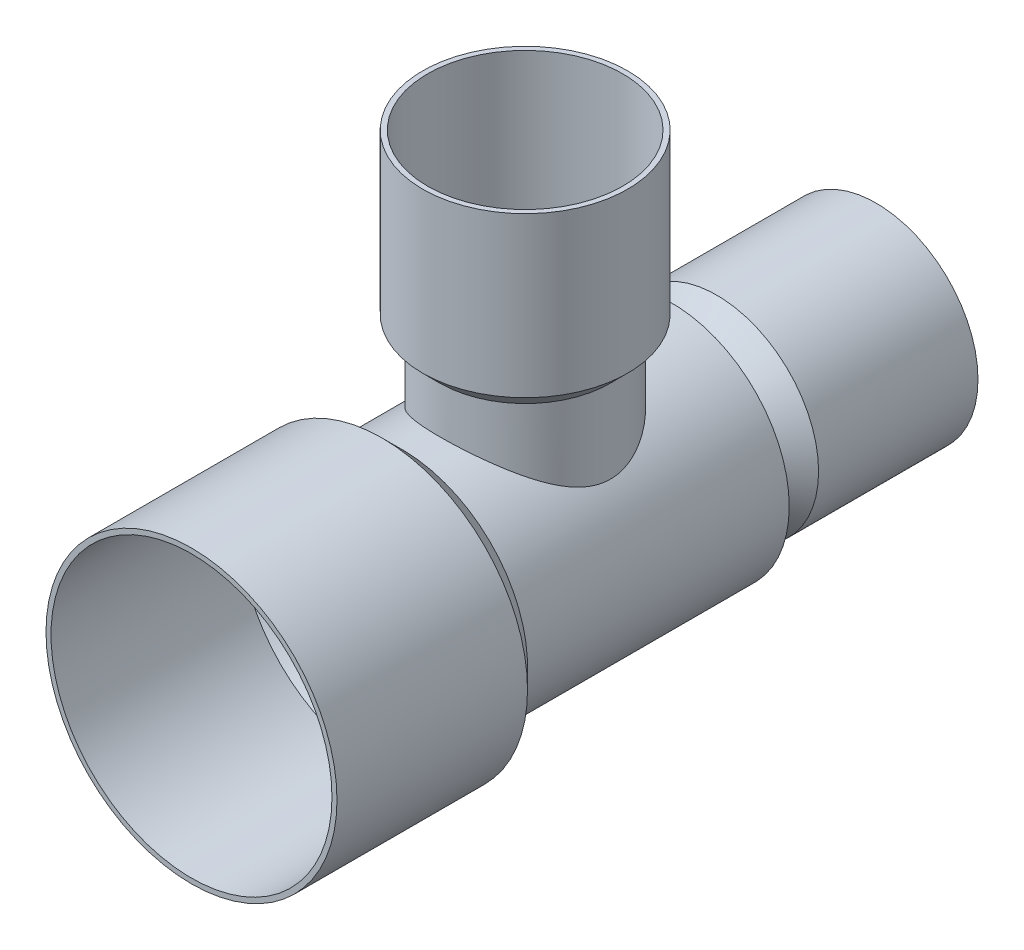
ISO-10303-21;
HEADER;
FILE_DESCRIPTION(('STEP AP214'),'2;1');
FILE_NAME('part.step','',(''),(''),'','','');
FILE_SCHEMA(('AUTOMOTIVE_DESIGN { 1 0 10303 214 1 1 1 1 }'));
ENDSEC;
DATA;
#1=APPLICATION_CONTEXT('core data for automotive mechanical design processes');
#2=APPLICATION_PROTOCOL_DEFINITION('international standard','automotive_design',2000,#1);
#3=PRODUCT_CONTEXT('',#1,'mechanical');
#4=PRODUCT('Part','Part','',(#3));
#5=PRODUCT_RELATED_PRODUCT_CATEGORY('part','',(#4));
#6=PRODUCT_DEFINITION_FORMATION('','',#4);
#7=PRODUCT_DEFINITION_CONTEXT('part definition',#1,'design');
#8=PRODUCT_DEFINITION('design','',#6,#7);
#9=PRODUCT_DEFINITION_SHAPE('','',#8);
#10=(LENGTH_UNIT() NAMED_UNIT(*) SI_UNIT(.MILLI.,.METRE.));
#11=(NAMED_UNIT(*) PLANE_ANGLE_UNIT() SI_UNIT($,.RADIAN.));
#12=(NAMED_UNIT(*) SI_UNIT($,.STERADIAN.) SOLID_ANGLE_UNIT());
#13=UNCERTAINTY_MEASURE_WITH_UNIT(LENGTH_MEASURE(1.E-05),#10,'distance_accuracy_value','');
#14=(GEOMETRIC_REPRESENTATION_CONTEXT(3) GLOBAL_UNCERTAINTY_ASSIGNED_CONTEXT((#13)) GLOBAL_UNIT_ASSIGNED_CONTEXT((#10,
#11,#12)) REPRESENTATION_CONTEXT('',''));
#15=CARTESIAN_POINT('',(0.,0.,0.));
#16=DIRECTION('',(0.,0.,1.));
#17=DIRECTION('',(1.,0.,0.));
#18=AXIS2_PLACEMENT_3D('',#15,#16,#17);
#19=CARTESIAN_POINT('',(0.,50.038,-14.3256));
#20=DIRECTION('',(0.,-1.,0.));
#21=DIRECTION('',(0.,0.,-1.));
#22=AXIS2_PLACEMENT_3D('',#19,#20,#21);
#23=PLANE('',#22);
#24=CARTESIAN_POINT('',(0.,50.038,0.));
#25=DIRECTION('',(0.,-1.,0.));
#26=DIRECTION('',(0.,0.,-1.));
#27=AXIS2_PLACEMENT_3D('',#24,#25,#26);
#28=CIRCLE('',#27,15.0622);
#29=CARTESIAN_POINT('',(0.,50.038,-15.0622));
#30=VERTEX_POINT('',#29);
#31=EDGE_CURVE('E11',#30,#30,#28,.F.);
#32=ORIENTED_EDGE('',*,*,#31,.T.);
#33=EDGE_LOOP('',(#32));
#34=FACE_BOUND('',#33,.T.);
#35=CARTESIAN_POINT('',(0.,50.038,0.));
#36=DIRECTION('',(0.,1.,0.));
#37=DIRECTION('',(0.,0.,1.));
#38=AXIS2_PLACEMENT_3D('',#35,#36,#37);
#39=CIRCLE('',#38,14.3256);
#40=CARTESIAN_POINT('',(0.,50.038,14.3256));
#41=VERTEX_POINT('',#40);
#42=EDGE_CURVE('E75',#41,#41,#39,.T.);
#43=ORIENTED_EDGE('',*,*,#42,.F.);
#44=EDGE_LOOP('',(#43));
#45=FACE_BOUND('',#44,.T.);
#46=ADVANCED_FACE('F37',(#34,#45),#23,.F.);
#47=CARTESIAN_POINT('',(0.,0.,-51.562));
#48=DIRECTION('',(0.,0.,1.));
#49=DIRECTION('',(1.,0.,0.));
#50=AXIS2_PLACEMENT_3D('',#47,#48,#49);
#51=PLANE('',#50);
#52=CARTESIAN_POINT('',(0.,0.,-51.562));
#53=DIRECTION('',(0.,0.,1.));
#54=DIRECTION('',(1.,0.,0.));
#55=AXIS2_PLACEMENT_3D('',#52,#53,#54);
#56=CIRCLE('',#55,14.9606);
#57=CARTESIAN_POINT('',(14.9606,0.,-51.562));
#58=VERTEX_POINT('',#57);
#59=EDGE_CURVE('E41',#58,#58,#56,.F.);
#60=ORIENTED_EDGE('',*,*,#59,.T.);
#61=EDGE_LOOP('',(#60));
#62=FACE_BOUND('',#61,.T.);
#63=CARTESIAN_POINT('',(0.,0.,-51.562));
#64=DIRECTION('',(0.,0.,-1.));
#65=DIRECTION('',(-1.,0.,0.));
#66=AXIS2_PLACEMENT_3D('',#63,#64,#65);
#67=CIRCLE('',#66,14.224);
#68=CARTESIAN_POINT('',(-14.224,0.,-51.562));
#69=VERTEX_POINT('',#68);
#70=EDGE_CURVE('E191',#69,#69,#67,.T.);
#71=ORIENTED_EDGE('',*,*,#70,.F.);
#72=EDGE_LOOP('',(#71));
#73=FACE_BOUND('',#72,.T.);
#74=ADVANCED_FACE('F121',(#62,#73),#51,.F.);
#75=CARTESIAN_POINT('',(0.,50.038,0.));
#76=DIRECTION('',(0.,1.,0.));
#77=DIRECTION('',(0.,0.,1.));
#78=AXIS2_PLACEMENT_3D('',#75,#76,#77);
#79=CYLINDRICAL_SURFACE('',#78,15.0622);
#80=ORIENTED_EDGE('',*,*,#31,.F.);
#81=EDGE_LOOP('',(#80));
#82=FACE_BOUND('',#81,.T.);
#83=CARTESIAN_POINT('',(0.,26.618890289956,0.));
#84=DIRECTION('',(0.,1.,0.));
#85=DIRECTION('',(0.,0.,1.));
#86=AXIS2_PLACEMENT_3D('',#83,#84,#85);
#87=CIRCLE('',#86,15.0622);
#88=CARTESIAN_POINT('',(0.,26.618890289956,15.0622));
#89=VERTEX_POINT('',#88);
#90=EDGE_CURVE('E50',#89,#89,#87,.T.);
#91=ORIENTED_EDGE('',*,*,#90,.T.);
#92=EDGE_LOOP('',(#91));
#93=FACE_BOUND('',#92,.T.);
#94=ADVANCED_FACE('F126',(#82,#93),#79,.T.);
#95=CARTESIAN_POINT('',(0.,50.038,0.));
#96=DIRECTION('',(0.,1.,0.));
#97=DIRECTION('',(0.,0.,1.));
#98=AXIS2_PLACEMENT_3D('',#95,#96,#97);
#99=CYLINDRICAL_SURFACE('',#98,12.5222);
#100=CARTESIAN_POINT('',(1.34456090077058,17.1941085126307,-12.449805172135));
#101=CARTESIAN_POINT('',(1.04960554109785,17.2171716260983,-12.4816577221123));
#102=CARTESIAN_POINT('',(0.752893083553737,17.232724220539,-12.5030845975657));
#103=CARTESIAN_POINT('',(0.158258565570606,17.2484394622937,-12.5247354042071));
#104=CARTESIAN_POINT('',(-0.139663676938202,17.2485997002302,-12.5249560159621));
#105=CARTESIAN_POINT('',(-0.734539921764581,17.233520512066,-12.50418179282));
#106=CARTESIAN_POINT('',(-1.03149331092926,17.2182727291892,-12.4831754451565));
#107=CARTESIAN_POINT('',(-1.62198778262268,17.1727127804712,-12.4202582427055));
#108=CARTESIAN_POINT('',(-1.91552897430673,17.1424010978848,-12.3783480585199));
#109=CARTESIAN_POINT('',(-2.49615375954969,17.0675083225458,-12.2744211104694));
#110=CARTESIAN_POINT('',(-2.7832553594187,17.0229743066508,-12.2124706725338));
#111=CARTESIAN_POINT('',(-3.35015045419948,16.9205402339201,-12.0692777094471));
#112=CARTESIAN_POINT('',(-3.62994387233123,16.8626400367216,-11.988034981701));
#113=CARTESIAN_POINT('',(-4.18065026197691,16.7346138021935,-11.8072710815234));
#114=CARTESIAN_POINT('',(-4.45156358990073,16.6644882562542,-11.7077506437445));
#115=CARTESIAN_POINT('',(-4.98335661892926,16.5132622237756,-11.4914789131753));
#116=CARTESIAN_POINT('',(-5.24423247080276,16.4321575797296,-11.3747210914989));
#117=CARTESIAN_POINT('',(-5.76822213611171,16.2558660426931,-11.118567602416));
#118=CARTESIAN_POINT('',(-6.03073928551594,16.1601644618955,-10.9783072846251));
#119=CARTESIAN_POINT('',(-6.54269313057134,15.9597614960201,-10.6811195006015));
#120=CARTESIAN_POINT('',(-6.79212444376587,15.8550564536565,-10.5241852551152));
#121=CARTESIAN_POINT('',(-7.27723916309594,15.6383373606618,-10.1947669159518));
#122=CARTESIAN_POINT('',(-7.51291909228215,15.5263214765688,-10.0222789174292));
#123=CARTESIAN_POINT('',(-7.97003522925165,15.2967051710687,-9.66274322737043));
#124=CARTESIAN_POINT('',(-8.19146974565239,15.1791040893923,-9.47569381273771));
#125=CARTESIAN_POINT('',(-8.66002735565722,14.9175736405543,-9.0513667169891));
#126=CARTESIAN_POINT('',(-8.90415069802936,14.772851925448,-8.81125818199132));
#127=CARTESIAN_POINT('',(-9.3713337574513,14.4809942176642,-8.31266190914105));
#128=CARTESIAN_POINT('',(-9.59438987639828,14.3338578175977,-8.05417104491043));
#129=CARTESIAN_POINT('',(-10.0190340927418,14.0403284520355,-7.51938255175463));
#130=CARTESIAN_POINT('',(-10.2206076806436,13.893936051805,-7.24307308764638));
#131=CARTESIAN_POINT('',(-10.6014115233237,13.6055978084326,-6.67330171460309));
#132=CARTESIAN_POINT('',(-10.7806456622911,13.4636511955183,-6.37984280053526));
#133=CARTESIAN_POINT('',(-11.089930763907,13.2095534599624,-5.82272683361756));
#134=CARTESIAN_POINT('',(-11.2233025803154,13.0961862886095,-5.56146623255911));
#135=CARTESIAN_POINT('',(-11.4725990699747,12.8783569129391,-5.02711344751731));
#136=CARTESIAN_POINT('',(-11.5885237350261,12.7738947128067,-4.7540212579736));
#137=CARTESIAN_POINT('',(-11.8016933590586,12.5772115856573,-4.1969404751696));
#138=CARTESIAN_POINT('',(-11.8989710581632,12.484969292719,-3.91297205023557));
#139=CARTESIAN_POINT('',(-12.0738352728174,12.3159460703532,-3.3345466985326));
#140=CARTESIAN_POINT('',(-12.1514269228824,12.2391611104255,-3.04009252955092));
#141=CARTESIAN_POINT('',(-12.2723107820328,12.1178139644925,-2.501266880353));
#142=CARTESIAN_POINT('',(-12.3193507364249,12.0698827885048,-2.25849261896897));
#143=CARTESIAN_POINT('',(-12.399198655909,11.9878428359151,-1.76832837466575));
#144=CARTESIAN_POINT('',(-12.4320099061177,11.9537308688604,-1.52093947094536));
#145=CARTESIAN_POINT('',(-12.4828245791848,11.9006580101274,-1.02326846215301));
#146=CARTESIAN_POINT('',(-12.5008428383234,11.8816819388059,-0.772989511755149));
#147=CARTESIAN_POINT('',(-12.5217843510112,11.8596106719307,-0.271088983141447));
#148=CARTESIAN_POINT('',(-12.5247074310089,11.8565156589638,-0.0194673895223337));
#149=CARTESIAN_POINT('',(-12.51539694256,11.8663429208601,0.48330393297363));
#150=CARTESIAN_POINT('',(-12.5031557444799,11.8792732585914,0.734453360596071));
#151=CARTESIAN_POINT('',(-12.4637440766511,11.9206166486355,1.2342733044769));
#152=CARTESIAN_POINT('',(-12.4365736417468,11.9490296648123,1.48294382651959));
#153=CARTESIAN_POINT('',(-12.3677511098062,12.0202490025384,1.97645569931487));
#154=CARTESIAN_POINT('',(-12.3260824858621,12.063071748318,2.22129234544067));
#155=CARTESIAN_POINT('',(-12.2288958921346,12.1615826992391,2.70567510606767));
#156=CARTESIAN_POINT('',(-12.1733698311503,12.2172784193565,2.94521804036634));
#157=CARTESIAN_POINT('',(-12.0282507437524,12.3604201665445,3.49763096042766));
#158=CARTESIAN_POINT('',(-11.9334828885486,12.4522412584906,3.80801541207961));
#159=CARTESIAN_POINT('',(-11.7221318333478,12.6513986842147,4.41596558762099));
#160=CARTESIAN_POINT('',(-11.6055496021645,12.7587343289167,4.71353188006506));
#161=CARTESIAN_POINT('',(-11.3517578832006,12.9850586959493,5.29566412197841));
#162=CARTESIAN_POINT('',(-11.2145178204916,13.1040645984722,5.58020997241222));
#163=CARTESIAN_POINT('',(-10.9206391973314,13.3499647742725,6.13545454810407));
#164=CARTESIAN_POINT('',(-10.7640021231652,13.4768584427835,6.40615433206595));
#165=CARTESIAN_POINT('',(-10.4272353852643,13.7391724473193,6.94126145452216));
#166=CARTESIAN_POINT('',(-10.2465502134178,13.8747338017022,7.20524947580339));
#167=CARTESIAN_POINT('',(-9.86609090160776,14.1478020154099,7.7180088392892));
#168=CARTESIAN_POINT('',(-9.66631673879028,14.2853088770637,7.96678016327522));
#169=CARTESIAN_POINT('',(-9.24805239159297,14.5595777867687,8.4487189691638));
#170=CARTESIAN_POINT('',(-9.0295546445001,14.6963395099009,8.68188007750826));
#171=CARTESIAN_POINT('',(-8.57429406785809,14.966522064099,9.13177990223785));
#172=CARTESIAN_POINT('',(-8.33752933476916,15.0999425450616,9.34851690244579));
#173=CARTESIAN_POINT('',(-7.79821487300854,15.3864730069679,9.80516847672354));
#174=CARTESIAN_POINT('',(-7.49183818144704,15.5383514024634,10.0413655701822));
#175=CARTESIAN_POINT('',(-6.85446116806715,15.8298576828286,10.4868020617982));
#176=CARTESIAN_POINT('',(-6.52345583644165,15.9694830626068,10.6960359514886));
#177=CARTESIAN_POINT('',(-5.83886379232392,16.2322855223453,11.0845752702996));
#178=CARTESIAN_POINT('',(-5.4853141223822,16.3554886061157,11.2639281297211));
#179=CARTESIAN_POINT('',(-4.75745971532817,16.5818220086651,11.5901208691603));
#180=CARTESIAN_POINT('',(-4.38316530832558,16.6849622046529,11.7369767527675));
#181=CARTESIAN_POINT('',(-3.72788504382176,16.841215384444,11.9578841392792));
#182=CARTESIAN_POINT('',(-3.45121299217682,16.9001704142957,12.040708736006));
#183=CARTESIAN_POINT('',(-2.89050677088366,17.005042115879,12.1874682864466));
#184=CARTESIAN_POINT('',(-2.60647427023359,17.0509617156758,12.2514074823977));
#185=CARTESIAN_POINT('',(-2.03297425915256,17.1288036966274,12.3595146609856));
#186=CARTESIAN_POINT('',(-1.74351053383967,17.1607354740216,12.4036959163234));
#187=CARTESIAN_POINT('',(-1.16094640910282,17.2099639094067,12.471715662705));
#188=CARTESIAN_POINT('',(-0.867845876374377,17.227260029321,12.4955534058243));
#189=CARTESIAN_POINT('',(-0.27960726813836,17.2468490650633,12.5225465015219));
#190=CARTESIAN_POINT('',(0.0155336926637419,17.249112206204,12.5256608087753));
#191=CARTESIAN_POINT('',(0.605022810201967,17.2385052218925,12.5110498574993));
#192=CARTESIAN_POINT('',(0.899370970349472,17.2256351616622,12.4933246887851));
#193=CARTESIAN_POINT('',(1.4851332183651,17.1850461169969,12.437301279316));
#194=CARTESIAN_POINT('',(1.77654656618508,17.1573234783188,12.3989979756285));
#195=CARTESIAN_POINT('',(2.35429376166629,17.0876324192434,12.3023811264764));
#196=CARTESIAN_POINT('',(2.64062760117626,17.0456639759875,12.2440675489037));
#197=CARTESIAN_POINT('',(3.20001413516537,16.9494502469137,12.1097600232484));
#198=CARTESIAN_POINT('',(3.47322066737313,16.8955013676848,12.0341918726072));
#199=CARTESIAN_POINT('',(4.01152752675063,16.7758423938931,11.8656097129785));
#200=CARTESIAN_POINT('',(4.27662803010261,16.7101325551643,11.7725960834774));
#201=CARTESIAN_POINT('',(4.79749231135727,16.5681063746411,11.5701182273379));
#202=CARTESIAN_POINT('',(5.05325685173413,16.4917909014739,11.4606553478735));
#203=CARTESIAN_POINT('',(5.55459695354013,16.3297612236943,11.2262441543689));
#204=CARTESIAN_POINT('',(5.80016879052476,16.2440436244743,11.1012902452069));
#205=CARTESIAN_POINT('',(6.30816782225595,16.0540973962813,10.8215555361195));
#206=CARTESIAN_POINT('',(6.5692441165898,15.9488749625474,10.6649961612575));
#207=CARTESIAN_POINT('',(7.07701658100058,15.7301467275538,10.3350405140908));
#208=CARTESIAN_POINT('',(7.32370655427444,15.6166374034944,10.1616370708098));
#209=CARTESIAN_POINT('',(7.80227603023342,15.3831286785668,9.79898973037361));
#210=CARTESIAN_POINT('',(8.03414227102818,15.263123638803,9.6097319895481));
#211=CARTESIAN_POINT('',(8.48236513211756,15.0186502432128,9.21649850312105));
#212=CARTESIAN_POINT('',(8.69872590636336,14.8941830963022,9.01252672904891));
#213=CARTESIAN_POINT('',(9.15527725797132,14.6188232081482,8.5504945143419));
#214=CARTESIAN_POINT('',(9.39220026395545,14.4673973697522,8.2895144429544));
#215=CARTESIAN_POINT('',(9.84324932262367,14.1643738897102,7.74854811381992));
#216=CARTESIAN_POINT('',(10.0573705534979,14.0127762185502,7.46855785647505));
#217=CARTESIAN_POINT('',(10.4621028953906,13.7132414475216,6.89017400752215));
#218=CARTESIAN_POINT('',(10.652712477722,13.5653045861721,6.59177922117323));
#219=CARTESIAN_POINT('',(11.0093951185683,13.2774586986658,5.97703400345357));
#220=CARTESIAN_POINT('',(11.1754755230761,13.1375472767606,5.66068898725851));
#221=CARTESIAN_POINT('',(11.4453115893983,12.9024823824461,5.08776533185127));
#222=CARTESIAN_POINT('',(11.5544974641951,12.8045959339134,4.83485751103322));
#223=CARTESIAN_POINT('',(11.7570083755159,12.6189077925319,4.31913980422897));
#224=CARTESIAN_POINT('',(11.8503344070077,12.5311054671676,4.05633054067465));
#225=CARTESIAN_POINT('',(12.019982258127,12.3684693994092,3.52192479821783));
#226=CARTESIAN_POINT('',(12.0963360312348,12.2936113470418,3.2503459534128));
#227=CARTESIAN_POINT('',(12.2311639493995,12.1594782519031,2.69899989906632));
#228=CARTESIAN_POINT('',(12.2896413538265,12.1002003687009,2.41923419242729));
#229=CARTESIAN_POINT('',(12.3803314680599,12.007337824601,1.89542039349734));
#230=CARTESIAN_POINT('',(12.4151610452342,11.9712393717642,1.65227056002616));
#231=CARTESIAN_POINT('',(12.470542433728,11.913538387462,1.16264217802578));
#232=CARTESIAN_POINT('',(12.4910958232025,11.8919342537374,0.9161640004988));
#233=CARTESIAN_POINT('',(12.5175452374396,11.8640906354179,0.421686395358653));
#234=CARTESIAN_POINT('',(12.5234494149726,11.8578426046627,0.173687890937244));
#235=CARTESIAN_POINT('',(12.5205106608401,11.8609455179611,-0.322130072000294));
#236=CARTESIAN_POINT('',(12.5116673256724,11.8702968888249,-0.569949525431864));
#237=CARTESIAN_POINT('',(12.4794363946505,11.9041764200966,-1.06305581368968));
#238=CARTESIAN_POINT('',(12.4560793983498,11.9286726496333,-1.30834687593218));
#239=CARTESIAN_POINT('',(12.3952656266146,11.9918519413242,-1.79529965844101));
#240=CARTESIAN_POINT('',(12.3578089039665,12.030534950366,-2.03696139229128));
#241=CARTESIAN_POINT('',(12.2693272342035,12.1207592560818,-2.51563535002449));
#242=CARTESIAN_POINT('',(12.2182859221344,12.1723160567724,-2.75264159331236));
#243=CARTESIAN_POINT('',(12.1033157222789,12.286640169895,-3.22077157056563));
#244=CARTESIAN_POINT('',(12.0393834708036,12.3494104078093,-3.45189375141248));
#245=CARTESIAN_POINT('',(11.8692167345837,12.5134416955795,-4.0054026846984));
#246=CARTESIAN_POINT('',(11.7566043751075,12.6196585663854,-4.32437506955656));
#247=CARTESIAN_POINT('',(11.5081536442993,12.8466305336933,-4.94778787872182));
#248=CARTESIAN_POINT('',(11.3723055082338,12.9673917360489,-5.25222212435251));
#249=CARTESIAN_POINT('',(11.0785645764641,13.2192323069227,-5.84644464512642));
#250=CARTESIAN_POINT('',(10.920636716965,13.3503279397494,-6.13620860607302));
#251=CARTESIAN_POINT('',(10.5839636895903,13.6187841630395,-6.70022908965719));
#252=CARTESIAN_POINT('',(10.4052208276933,13.7561440584963,-6.97448732509679));
#253=CARTESIAN_POINT('',(10.0221788228574,14.03778038218,-7.51493653403785));
#254=CARTESIAN_POINT('',(9.81729029691888,14.1821419675044,-7.78066515227076));
#255=CARTESIAN_POINT('',(9.38680582815815,14.4706683355694,-8.2949270103547));
#256=CARTESIAN_POINT('',(9.16120870704416,14.6148331066375,-8.54345927034285));
#257=CARTESIAN_POINT('',(8.68992461499414,14.8998731494056,-9.02238857518042));
#258=CARTESIAN_POINT('',(8.44425020010735,15.0407504072587,-9.25279678024964));
#259=CARTESIAN_POINT('',(7.93317134728956,15.3164712986556,-9.69455223811933));
#260=CARTESIAN_POINT('',(7.66776881138709,15.4513155118547,-9.90590132411143));
#261=CARTESIAN_POINT('',(7.13701680252703,15.7031323050917,-10.2941199708794));
#262=CARTESIAN_POINT('',(6.87295555373936,15.8206953875419,-10.4723663499623));
#263=CARTESIAN_POINT('',(6.32897791436464,16.0460552932628,-10.8098075068937));
#264=CARTESIAN_POINT('',(6.04906385503441,16.1538535464844,-10.9690050753286));
#265=CARTESIAN_POINT('',(5.474741998558,16.3574174999957,-11.2666390621789));
#266=CARTESIAN_POINT('',(5.18035513626729,16.4531999075007,-11.4051043604715));
#267=CARTESIAN_POINT('',(4.57813128193065,16.6308262852116,-11.65988890283));
#268=CARTESIAN_POINT('',(4.27029859290699,16.7126746741974,-11.7762151690491));
#269=CARTESIAN_POINT('',(3.74745394318527,16.8359159841604,-11.950345449375));
#270=CARTESIAN_POINT('',(3.53564400802603,16.8817074860083,-12.0147421093613));
#271=CARTESIAN_POINT('',(3.10752077307258,16.9657327117051,-12.1325213599562));
#272=CARTESIAN_POINT('',(2.89120808595406,17.0039674564443,-12.1859054383672));
#273=CARTESIAN_POINT('',(2.45477083136642,17.0724372199445,-12.2812660528638));
#274=CARTESIAN_POINT('',(2.23464533626234,17.1026702619608,-12.3232397701975));
#275=CARTESIAN_POINT('',(1.79153763557279,17.1547478677482,-12.3954135514274));
#276=CARTESIAN_POINT('',(1.56855594400275,17.1765939195615,-12.4256157038808));
#277=CARTESIAN_POINT('',(1.34456090077058,17.1941085126307,-12.449805172135));
#278=B_SPLINE_CURVE_WITH_KNOTS('',3,(#100,#101,#102,#103,#104,#105,#106,#107,#108,#109,#110,
#111,#112,#113,#114,#115,#116,#117,#118,#119,#120,#121,#122,#123,#124,#125,#126,#127,#128,#129,
#130,#131,#132,#133,#134,#135,#136,#137,#138,#139,#140,#141,#142,#143,#144,#145,#146,#147,#148,
#149,#150,#151,#152,#153,#154,#155,#156,#157,#158,#159,#160,#161,#162,#163,#164,#165,#166,#167,
#168,#169,#170,#171,#172,#173,#174,#175,#176,#177,#178,#179,#180,#181,#182,#183,#184,#185,#186,
#187,#188,#189,#190,#191,#192,#193,#194,#195,#196,#197,#198,#199,#200,#201,#202,#203,#204,#205,
#206,#207,#208,#209,#210,#211,#212,#213,#214,#215,#216,#217,#218,#219,#220,#221,#222,#223,#224,
#225,#226,#227,#228,#229,#230,#231,#232,#233,#234,#235,#236,#237,#238,#239,#240,#241,#242,#243,
#244,#245,#246,#247,#248,#249,#250,#251,#252,#253,#254,#255,#256,#257,#258,#259,#260,#261,#262,
#263,#264,#265,#266,#267,#268,#269,#270,#271,#272,#273,#274,#275,#276,#277),.UNSPECIFIED.,.T.,
.F.,(4,2,2,2,2,2,2,2,2,2,2,2,2,2,2,2,2,2,2,2,2,2,2,2,2,2,2,2,2,2,2,2,2,2,2,2,2,2,2,2,2,2,2,2,2,
2,2,2,2,2,2,2,2,2,2,2,2,2,2,2,2,2,2,2,2,2,2,2,2,2,2,2,2,2,2,2,2,2,2,2,2,2,2,2,2,2,2,2,4),(0.,
0.892480885177587,1.78510147085882,2.67820644296431,3.57128276581433,4.46143306447451,
5.35159271132645,6.2417165870151,7.13217847794263,8.06921644218135,9.00663685407003,
9.94429326865868,10.8820608081278,11.9961746069851,13.1104783442262,14.2255299852349,
15.3403874795006,16.2830745685454,17.225762100618,18.1667790001852,19.1075502108206,
19.8624765435203,20.6172284862527,21.3712225404884,22.1252252634857,22.879607503498,
23.6339879828135,24.3892312351082,25.1449165013764,26.1551999330537,27.1654385069619,
28.1771872751418,29.1888585665546,30.2302883532493,31.2717193867967,32.3135730694876,
33.355535467188,34.6006071959087,35.845932885553,37.0892626319068,38.3319787137416,
39.2153627338072,40.0985481676839,40.9811394136257,41.8637631064284,42.7481344254981,
43.6325019330631,44.5170871253188,45.4016737369703,46.2664239138262,47.1311552822024,
47.9958158686665,48.8607896721072,49.826137237903,50.7918975946671,51.7585102049436,
52.724862881791,53.874567602453,55.0245149662791,56.1745370583476,57.3242140406347,
58.2005698707278,59.0768707023071,59.9515074894295,60.8259847101561,61.5699979269491,
62.3139288840264,63.0574457259884,63.8009829114174,64.5429577709339,65.284929852676,
66.0277998441112,66.7708639272708,67.8329169574506,68.8954174123347,69.9596247570805,
71.0237143161578,72.1185626549306,73.2134733277894,74.3077044237794,75.4018301592021,
76.4196191601889,77.4372588755048,78.4534675685563,79.4693533970081,80.1471660564472,
80.8248870831766,81.5027753785054,82.1805433454312),.UNSPECIFIED.);
#279=CARTESIAN_POINT('',(1.34456090077058,17.1941085126307,-12.449805172135));
#280=VERTEX_POINT('',#279);
#281=EDGE_CURVE('E62',#280,#280,#278,.T.);
#282=ORIENTED_EDGE('',*,*,#281,.T.);
#283=EDGE_LOOP('',(#282));
#284=FACE_BOUND('',#283,.T.);
#285=CARTESIAN_POINT('',(0.,24.078890289956,0.));
#286=DIRECTION('',(0.,1.,0.));
#287=DIRECTION('',(0.,0.,1.));
#288=AXIS2_PLACEMENT_3D('',#285,#286,#287);
#289=CIRCLE('',#288,12.5222);
#290=CARTESIAN_POINT('',(0.,24.078890289956,12.5222));
#291=VERTEX_POINT('',#290);
#292=EDGE_CURVE('E45',#291,#291,#289,.T.);
#293=ORIENTED_EDGE('',*,*,#292,.F.);
#294=EDGE_LOOP('',(#293));
#295=FACE_BOUND('',#294,.T.);
#296=ADVANCED_FACE('F133',(#284,#295),#99,.T.);
#297=CARTESIAN_POINT('',(0.,23.863145144978,0.));
#298=DIRECTION('',(0.,1.,0.));
#299=DIRECTION('',(0.,0.,1.));
#300=AXIS2_PLACEMENT_3D('',#297,#298,#299);
#301=CONICAL_SURFACE('',#300,12.306454855022,0.78539816339745);
#302=ORIENTED_EDGE('',*,*,#90,.F.);
#303=EDGE_LOOP('',(#302));
#304=FACE_BOUND('',#303,.T.);
#305=ORIENTED_EDGE('',*,*,#292,.T.);
#306=EDGE_LOOP('',(#305));
#307=FACE_BOUND('',#306,.T.);
#308=ADVANCED_FACE('F137',(#304,#307),#301,.T.);
#309=CARTESIAN_POINT('',(0.,0.,-51.562));
#310=DIRECTION('',(0.,0.,1.));
#311=DIRECTION('',(0.,-1.,0.));
#312=AXIS2_PLACEMENT_3D('',#309,#310,#311);
#313=CYLINDRICAL_SURFACE('',#312,17.2466);
#314=CARTESIAN_POINT('',(0.,0.,-21.5437489673051));
#315=DIRECTION('',(0.,0.,1.));
#316=DIRECTION('',(1.,0.,0.));
#317=AXIS2_PLACEMENT_3D('',#314,#315,#316);
#318=CIRCLE('',#317,17.2466);
#319=CARTESIAN_POINT('',(17.2466,0.,-21.5437489673051));
#320=VERTEX_POINT('',#319);
#321=EDGE_CURVE('E74',#320,#320,#318,.T.);
#322=ORIENTED_EDGE('',*,*,#321,.T.);
#323=EDGE_LOOP('',(#322));
#324=FACE_BOUND('',#323,.T.);
#325=CARTESIAN_POINT('',(0.,0.,18.0594));
#326=DIRECTION('',(0.,0.,-1.));
#327=DIRECTION('',(-1.,0.,0.));
#328=AXIS2_PLACEMENT_3D('',#325,#326,#327);
#329=CIRCLE('',#328,17.2466);
#330=CARTESIAN_POINT('',(-17.2466,0.,18.0594));
#331=VERTEX_POINT('',#330);
#332=EDGE_CURVE('E57',#331,#331,#329,.F.);
#333=ORIENTED_EDGE('',*,*,#332,.F.);
#334=EDGE_LOOP('',(#333));
#335=FACE_BOUND('',#334,.T.);
#336=ORIENTED_EDGE('',*,*,#281,.F.);
#337=EDGE_LOOP('',(#336));
#338=FACE_BOUND('',#337,.T.);
#339=ADVANCED_FACE('F139',(#324,#335,#338),#313,.T.);
#340=CARTESIAN_POINT('',(0.,0.,20.815145144978));
#341=DIRECTION('',(0.,0.,1.));
#342=DIRECTION('',(-1.,0.,0.));
#343=AXIS2_PLACEMENT_3D('',#340,#341,#342);
#344=CONICAL_SURFACE('',#343,21.158354855022,0.78539816339745);
#345=CARTESIAN_POINT('',(0.,0.,18.0594));
#346=DIRECTION('',(0.,0.,-1.));
#347=DIRECTION('',(-1.,0.,0.));
#348=AXIS2_PLACEMENT_3D('',#345,#346,#347);
#349=CIRCLE('',#348,18.402609710044);
#350=CARTESIAN_POINT('',(-18.402609710044,0.,18.0594));
#351=VERTEX_POINT('',#350);
#352=EDGE_CURVE('E58',#351,#351,#349,.T.);
#353=ORIENTED_EDGE('',*,*,#352,.F.);
#354=EDGE_LOOP('',(#353));
#355=FACE_BOUND('',#354,.T.);
#356=CARTESIAN_POINT('',(0.,0.,21.030890289956));
#357=DIRECTION('',(0.,0.,1.));
#358=DIRECTION('',(1.,0.,0.));
#359=AXIS2_PLACEMENT_3D('',#356,#357,#358);
#360=CIRCLE('',#359,21.3741);
#361=CARTESIAN_POINT('',(21.3741,0.,21.030890289956));
#362=VERTEX_POINT('',#361);
#363=EDGE_CURVE('E65',#362,#362,#360,.F.);
#364=ORIENTED_EDGE('',*,*,#363,.T.);
#365=EDGE_LOOP('',(#364));
#366=FACE_BOUND('',#365,.T.);
#367=ADVANCED_FACE('F160',(#355,#366),#344,.T.);
#368=CARTESIAN_POINT('',(0.,0.,18.0594));
#369=DIRECTION('',(0.,0.,-1.));
#370=DIRECTION('',(-1.,0.,0.));
#371=AXIS2_PLACEMENT_3D('',#368,#369,#370);
#372=PLANE('',#371);
#373=ORIENTED_EDGE('',*,*,#332,.T.);
#374=EDGE_LOOP('',(#373));
#375=FACE_BOUND('',#374,.T.);
#376=ORIENTED_EDGE('',*,*,#352,.T.);
#377=EDGE_LOOP('',(#376));
#378=FACE_BOUND('',#377,.T.);
#379=ADVANCED_FACE('F165',(#375,#378),#372,.T.);
#380=CARTESIAN_POINT('',(0.,0.,49.022));
#381=DIRECTION('',(0.,0.,1.));
#382=DIRECTION('',(1.,0.,0.));
#383=AXIS2_PLACEMENT_3D('',#380,#381,#382);
#384=PLANE('',#383);
#385=CARTESIAN_POINT('',(0.,0.,49.022));
#386=DIRECTION('',(0.,0.,1.));
#387=DIRECTION('',(1.,0.,0.));
#388=AXIS2_PLACEMENT_3D('',#385,#386,#387);
#389=CIRCLE('',#388,20.6375);
#390=CARTESIAN_POINT('',(20.6375,0.,49.022));
#391=VERTEX_POINT('',#390);
#392=EDGE_CURVE('E206',#391,#391,#389,.T.);
#393=ORIENTED_EDGE('',*,*,#392,.F.);
#394=EDGE_LOOP('',(#393));
#395=FACE_BOUND('',#394,.T.);
#396=CARTESIAN_POINT('',(0.,0.,49.022));
#397=DIRECTION('',(0.,0.,1.));
#398=DIRECTION('',(1.,0.,0.));
#399=AXIS2_PLACEMENT_3D('',#396,#397,#398);
#400=CIRCLE('',#399,21.3741);
#401=CARTESIAN_POINT('',(21.3741,0.,49.022));
#402=VERTEX_POINT('',#401);
#403=EDGE_CURVE('E55',#402,#402,#400,.T.);
#404=ORIENTED_EDGE('',*,*,#403,.T.);
#405=EDGE_LOOP('',(#404));
#406=FACE_BOUND('',#405,.T.);
#407=ADVANCED_FACE('F132',(#395,#406),#384,.T.);
#408=CARTESIAN_POINT('',(0.,0.,21.336));
#409=DIRECTION('',(0.,0.,1.));
#410=DIRECTION('',(1.,0.,0.));
#411=AXIS2_PLACEMENT_3D('',#408,#409,#410);
#412=CYLINDRICAL_SURFACE('',#411,21.3741);
#413=ORIENTED_EDGE('',*,*,#363,.F.);
#414=EDGE_LOOP('',(#413));
#415=FACE_BOUND('',#414,.T.);
#416=ORIENTED_EDGE('',*,*,#403,.F.);
#417=EDGE_LOOP('',(#416));
#418=FACE_BOUND('',#417,.T.);
#419=ADVANCED_FACE('F170',(#415,#418),#412,.T.);
#420=CARTESIAN_POINT('',(0.,0.,-25.2759143124276));
#421=DIRECTION('',(0.,0.,1.));
#422=DIRECTION('',(-1.,0.,0.));
#423=AXIS2_PLACEMENT_3D('',#420,#421,#422);
#424=CONICAL_SURFACE('',#423,10.7823,1.0471975511966);
#425=ORIENTED_EDGE('',*,*,#321,.F.);
#426=EDGE_LOOP('',(#425));
#427=FACE_BOUND('',#426,.T.);
#428=CARTESIAN_POINT('',(0.,0.,-24.7959364076102));
#429=DIRECTION('',(0.,0.,-1.));
#430=DIRECTION('',(-1.,0.,0.));
#431=AXIS2_PLACEMENT_3D('',#428,#429,#430);
#432=CIRCLE('',#431,11.6136461176542);
#433=CARTESIAN_POINT('',(-11.6136461176542,0.,-24.7959364076102));
#434=VERTEX_POINT('',#433);
#435=EDGE_CURVE('E72',#434,#434,#432,.T.);
#436=ORIENTED_EDGE('',*,*,#435,.F.);
#437=EDGE_LOOP('',(#436));
#438=FACE_BOUND('',#437,.T.);
#439=ADVANCED_FACE('F173',(#427,#438),#424,.T.);
#440=CARTESIAN_POINT('',(0.,0.,-28.448));
#441=DIRECTION('',(0.,0.,-1.));
#442=DIRECTION('',(-1.,0.,0.));
#443=AXIS2_PLACEMENT_3D('',#440,#441,#442);
#444=CYLINDRICAL_SURFACE('',#443,14.9606);
#445=CARTESIAN_POINT('',(0.,0.,-28.142890289956));
#446=DIRECTION('',(0.,0.,-1.));
#447=DIRECTION('',(-1.,0.,0.));
#448=AXIS2_PLACEMENT_3D('',#445,#446,#447);
#449=CIRCLE('',#448,14.9606);
#450=CARTESIAN_POINT('',(-14.9606,0.,-28.142890289956));
#451=VERTEX_POINT('',#450);
#452=EDGE_CURVE('E53',#451,#451,#449,.T.);
#453=ORIENTED_EDGE('',*,*,#452,.T.);
#454=EDGE_LOOP('',(#453));
#455=FACE_BOUND('',#454,.T.);
#456=ORIENTED_EDGE('',*,*,#59,.F.);
#457=EDGE_LOOP('',(#456));
#458=FACE_BOUND('',#457,.T.);
#459=ADVANCED_FACE('F176',(#455,#458),#444,.T.);
#460=CARTESIAN_POINT('',(0.,0.,-27.927145144978));
#461=DIRECTION('',(0.,0.,-1.));
#462=DIRECTION('',(-1.,0.,0.));
#463=AXIS2_PLACEMENT_3D('',#460,#461,#462);
#464=CONICAL_SURFACE('',#463,14.744854855022,0.78539816339745);
#465=ORIENTED_EDGE('',*,*,#435,.T.);
#466=EDGE_LOOP('',(#465));
#467=FACE_BOUND('',#466,.T.);
#468=ORIENTED_EDGE('',*,*,#452,.F.);
#469=EDGE_LOOP('',(#468));
#470=FACE_BOUND('',#469,.T.);
#471=ADVANCED_FACE('F39',(#467,#470),#464,.T.);
#472=CARTESIAN_POINT('',(0.,50.038,0.));
#473=DIRECTION('',(0.,1.,0.));
#474=DIRECTION('',(0.,0.,1.));
#475=AXIS2_PLACEMENT_3D('',#472,#473,#474);
#476=CYLINDRICAL_SURFACE('',#475,14.3256);
#477=ORIENTED_EDGE('',*,*,#42,.T.);
#478=EDGE_LOOP('',(#477));
#479=FACE_BOUND('',#478,.T.);
#480=CARTESIAN_POINT('',(0.,26.924,0.));
#481=DIRECTION('',(0.,1.,0.));
#482=DIRECTION('',(0.,0.,1.));
#483=AXIS2_PLACEMENT_3D('',#480,#481,#482);
#484=CIRCLE('',#483,14.3256);
#485=CARTESIAN_POINT('',(0.,26.924,14.3256));
#486=VERTEX_POINT('',#485);
#487=EDGE_CURVE('E85',#486,#486,#484,.T.);
#488=ORIENTED_EDGE('',*,*,#487,.F.);
#489=EDGE_LOOP('',(#488));
#490=FACE_BOUND('',#489,.T.);
#491=ADVANCED_FACE('F116',(#479,#490),#476,.F.);
#492=CARTESIAN_POINT('',(0.,50.038,0.));
#493=DIRECTION('',(0.,1.,0.));
#494=DIRECTION('',(0.,0.,1.));
#495=AXIS2_PLACEMENT_3D('',#492,#493,#494);
#496=CYLINDRICAL_SURFACE('',#495,11.7856);
#497=CARTESIAN_POINT('',(0.,16.51,11.7856));
#498=CARTESIAN_POINT('',(0.29169127283947,16.5100003514069,11.7856003627677));
#499=CARTESIAN_POINT('',(0.583377560796356,16.5022539190606,11.7747561037642));
#500=CARTESIAN_POINT('',(1.16432655776523,16.4714618302148,11.7315621905584));
#501=CARTESIAN_POINT('',(1.4535893276815,16.4484165593578,11.6992130784357));
#502=CARTESIAN_POINT('',(2.02750636445264,16.387575474934,11.6135182561208));
#503=CARTESIAN_POINT('',(2.31215891404158,16.3497742908061,11.5601649011659));
#504=CARTESIAN_POINT('',(2.87468726462994,16.2603012491176,11.4332710351912));
#505=CARTESIAN_POINT('',(3.1525629279313,16.2086291099719,11.3597301143563));
#506=CARTESIAN_POINT('',(3.69836130948366,16.0928451441937,11.193901711687));
#507=CARTESIAN_POINT('',(3.96632760958165,16.0287981939213,11.1017118853782));
#508=CARTESIAN_POINT('',(4.49236388689646,15.8893931421704,10.8994700739479));
#509=CARTESIAN_POINT('',(4.75043393050397,15.814035116591,10.7894182086827));
#510=CARTESIAN_POINT('',(5.25551278170939,15.6534311047933,10.5526177729681));
#511=CARTESIAN_POINT('',(5.50252358358113,15.5681869113476,10.4258722292116));
#512=CARTESIAN_POINT('',(5.98476986262616,15.3892433647399,10.1567310740588));
#513=CARTESIAN_POINT('',(6.22000091684873,15.2955408721975,10.0143296475191));
#514=CARTESIAN_POINT('',(6.6984435571011,15.0925272745232,9.70154873332772));
#515=CARTESIAN_POINT('',(6.94048924962359,14.9825696400477,9.52980618210788));
#516=CARTESIAN_POINT('',(7.40915608719233,14.7564296489171,9.17017104110195));
#517=CARTESIAN_POINT('',(7.6357767614645,14.6402471024698,8.98227795879468));
#518=CARTESIAN_POINT('',(8.07348873425211,14.4035022717015,8.59100993030496));
#519=CARTESIAN_POINT('',(8.28455590427672,14.2829335985436,8.3876118855629));
#520=CARTESIAN_POINT('',(8.69035710618936,14.0397203782095,7.96640284257183));
#521=CARTESIAN_POINT('',(8.88509436088613,13.917076246407,7.7485947034947));
#522=CARTESIAN_POINT('',(9.29221822129966,13.6493413573427,7.25772621085809));
#523=CARTESIAN_POINT('',(9.50126313335178,13.5042710437892,6.9818717878263));
#524=CARTESIAN_POINT('',(9.89525498933722,13.2182940417017,6.4112814693278));
#525=CARTESIAN_POINT('',(10.0801953725816,13.0773884947552,6.11654046580061));
#526=CARTESIAN_POINT('',(10.4245893956405,12.8045395960191,5.50908946135526));
#527=CARTESIAN_POINT('',(10.5840739260096,12.6725854952927,5.1964018750502));
#528=CARTESIAN_POINT('',(10.8761890756426,12.4227828404771,4.55339717247887));
#529=CARTESIAN_POINT('',(11.0088342552351,12.3049266525448,4.22308973853762));
#530=CARTESIAN_POINT('',(11.2072855315218,12.1238889203481,3.6546456019841));
#531=CARTESIAN_POINT('',(11.2808831951145,12.0552961204819,3.42093035726757));
#532=CARTESIAN_POINT('',(11.4139687848284,11.9293675964822,2.94657803056825));
#533=CARTESIAN_POINT('',(11.4734610283496,11.8720284287545,2.70594309192322));
#534=CARTESIAN_POINT('',(11.5774617653944,11.7706312844495,2.21913843297348));
#535=CARTESIAN_POINT('',(11.6219964863482,11.7265500749012,1.97297921669075));
#536=CARTESIAN_POINT('',(11.6954889798381,11.6532547051097,1.47612805542113));
#537=CARTESIAN_POINT('',(11.7244467592187,11.6240405383339,1.22543611242601));
#538=CARTESIAN_POINT('',(11.7663599585136,11.5816139441591,0.719678740250826));
#539=CARTESIAN_POINT('',(11.7792089111482,11.5685079910466,0.46459539297483));
#540=CARTESIAN_POINT('',(11.7882769489896,11.5592677408311,-0.0461701638607818));
#541=CARTESIAN_POINT('',(11.7844965459005,11.5631329215073,-0.301852354751335));
#542=CARTESIAN_POINT('',(11.7603809207432,11.5876585352006,-0.811796853392607));
#543=CARTESIAN_POINT('',(11.7400338958244,11.6083309424715,-1.06605801865781));
#544=CARTESIAN_POINT('',(11.6831942570202,11.6655338616849,-1.57095778451463));
#545=CARTESIAN_POINT('',(11.646699812274,11.7020661718793,-1.82159597098928));
#546=CARTESIAN_POINT('',(11.5525615161308,11.7950557045474,-2.34934919467766));
#547=CARTESIAN_POINT('',(11.4928070482175,11.8534660396465,-2.62574228305557));
#548=CARTESIAN_POINT('',(11.3547444548565,11.985782906484,-3.17001994206212));
#549=CARTESIAN_POINT('',(11.2764334844869,12.0596918141291,-3.43790320088885));
#550=CARTESIAN_POINT('',(11.1022559344367,12.220231165096,-3.96451056917933));
#551=CARTESIAN_POINT('',(11.006357556168,12.3068845937848,-4.22321705898695));
#552=CARTESIAN_POINT('',(10.7981326801274,12.4899822554631,-4.73031157385693));
#553=CARTESIAN_POINT('',(10.6858047469374,12.5864273437053,-4.97869869489885));
#554=CARTESIAN_POINT('',(10.4084241997534,12.8174348947332,-5.53995166966971));
#555=CARTESIAN_POINT('',(10.2378059545094,12.9545655221643,-5.84901927409531));
#556=CARTESIAN_POINT('',(9.87129023004059,13.2359795405201,-6.44836744454961));
#557=CARTESIAN_POINT('',(9.67538561705046,13.3802649428418,-6.73864267405804));
#558=CARTESIAN_POINT('',(9.2591475139269,13.6716084703262,-7.30005116145778));
#559=CARTESIAN_POINT('',(9.03879412081252,13.8186687724227,-7.57116852528724));
#560=CARTESIAN_POINT('',(8.57454564687617,14.1114343823115,-8.09317734908166));
#561=CARTESIAN_POINT('',(8.33065296651023,14.2571398266097,-8.34407086662675));
#562=CARTESIAN_POINT('',(7.81740128196525,14.5449564930393,-8.82688790615476));
#563=CARTESIAN_POINT('',(7.5478141677179,14.6870178839919,-9.05859915412158));
#564=CARTESIAN_POINT('',(6.98594561164647,14.9624378728491,-9.49864460974121));
#565=CARTESIAN_POINT('',(6.69366192230944,15.0957956064671,-9.70697649726128));
#566=CARTESIAN_POINT('',(6.08805060449775,15.3500288243361,-10.0978030983933));
#567=CARTESIAN_POINT('',(5.7747647910951,15.4709279627818,-10.280347027656));
#568=CARTESIAN_POINT('',(5.12824781929503,15.69707993165,-10.6176381753531));
#569=CARTESIAN_POINT('',(4.79502422505838,15.8023386437314,-10.77239584753));
#570=CARTESIAN_POINT('',(4.19840252257318,15.9694549793372,-11.0158723350809));
#571=CARTESIAN_POINT('',(3.93892583870028,16.0355293434773,-11.1113603002722));
#572=CARTESIAN_POINT('',(3.41145467807837,16.1559649722619,-11.2844735916928));
#573=CARTESIAN_POINT('',(3.14346204467501,16.2103287522037,-11.3621027540289));
#574=CARTESIAN_POINT('',(2.60060923061714,16.3062215759191,-11.4984990461366));
#575=CARTESIAN_POINT('',(2.3257527291665,16.3477573427237,-11.5572760567533));
#576=CARTESIAN_POINT('',(1.77083817958227,16.4171376353767,-11.6552079198908));
#577=CARTESIAN_POINT('',(1.49077998561101,16.4449817767556,-11.6943622213943));
#578=CARTESIAN_POINT('',(0.926615706661499,16.4864105236255,-11.7525494791659));
#579=CARTESIAN_POINT('',(0.642499550498304,16.4999493047505,-11.7715177749773));
#580=CARTESIAN_POINT('',(0.0733176826318491,16.5122909356326,-11.7888106422745));
#581=CARTESIAN_POINT('',(-0.211748027006379,16.5110938174155,-11.7871352586257));
#582=CARTESIAN_POINT('',(-0.780590019377176,16.493991627292,-11.7631669612496));
#583=CARTESIAN_POINT('',(-1.06436617730449,16.4780851610201,-11.7408720929083));
#584=CARTESIAN_POINT('',(-1.62840051790732,16.43193470414,-11.6760123489894));
#585=CARTESIAN_POINT('',(-1.90865876445686,16.4016909742382,-11.6334478419916));
#586=CARTESIAN_POINT('',(-2.45043718371782,16.3293166039527,-11.5311788567027));
#587=CARTESIAN_POINT('',(-2.71221515950086,16.2878186846379,-11.4723843556951));
#588=CARTESIAN_POINT('',(-3.22918299158012,16.1932556204129,-11.3377286964193));
#589=CARTESIAN_POINT('',(-3.48437310808148,16.1401909331475,-11.2618682133709));
#590=CARTESIAN_POINT('',(-3.98683864696483,16.0234748236402,-11.093946787618));
#591=CARTESIAN_POINT('',(-4.23411460991028,15.9598241263068,-11.0018869541868));
#592=CARTESIAN_POINT('',(-4.71978025964983,15.8230040468199,-10.8024528918601));
#593=CARTESIAN_POINT('',(-4.95816665555237,15.7498311837232,-10.6950730611639));
#594=CARTESIAN_POINT('',(-5.44628481792326,15.5881375694754,-10.455563207613));
#595=CARTESIAN_POINT('',(-5.69508665421876,15.4988268594849,-10.3220720537658));
#596=CARTESIAN_POINT('',(-6.18025616453239,15.3118309225532,-10.0391092087263));
#597=CARTESIAN_POINT('',(-6.41661854648991,15.2141421771186,-9.88963079684646));
#598=CARTESIAN_POINT('',(-6.8762884428137,15.0119892953041,-9.57572543491123));
#599=CARTESIAN_POINT('',(-7.0995906015005,14.9075224159074,-9.41129242198558));
#600=CARTESIAN_POINT('',(-7.53260369318931,14.6934790895437,-9.06843591925393));
#601=CARTESIAN_POINT('',(-7.74231304359599,14.5839020501513,-8.89001080568865));
#602=CARTESIAN_POINT('',(-8.18447093546082,14.3411683182556,-8.48645287934907));
#603=CARTESIAN_POINT('',(-8.41416968248238,14.2073321403908,-8.25870977846025));
#604=CARTESIAN_POINT('',(-8.85362637115448,13.9377139504676,-7.78574997868074));
#605=CARTESIAN_POINT('',(-9.06338093762107,13.8019316135161,-7.54053033444937));
#606=CARTESIAN_POINT('',(-9.46248915711889,13.531427807569,-7.0331996860814));
#607=CARTESIAN_POINT('',(-9.65183136297658,13.396706972707,-6.7710793344053));
#608=CARTESIAN_POINT('',(-10.0092549211042,13.1318076134253,-6.23058038952846));
#609=CARTESIAN_POINT('',(-10.1773400473952,13.0016282856784,-5.95220469519601));
#610=CARTESIAN_POINT('',(-10.4667679758485,12.7693279323129,-5.42430079260963));
#611=CARTESIAN_POINT('',(-10.591311113339,12.6659999366838,-5.17705653105583));
#612=CARTESIAN_POINT('',(-10.8237988270968,12.4679107468019,-4.67152385801421));
#613=CARTESIAN_POINT('',(-10.9317435706705,12.3731494662033,-4.41323555788035));
#614=CARTESIAN_POINT('',(-11.129864412544,12.1952418773269,-3.88657907225022));
#615=CARTESIAN_POINT('',(-11.220071203994,12.1120755793783,-3.61822927247219));
#616=CARTESIAN_POINT('',(-11.3817677870761,11.9602586284736,-3.07193841528569));
#617=CARTESIAN_POINT('',(-11.4532620669461,11.8916044955038,-2.79399967594063));
#618=CARTESIAN_POINT('',(-11.5648992056139,11.7829579046641,-2.28227580997258));
#619=CARTESIAN_POINT('',(-11.6083962552549,11.7400120138177,-2.04984758731407));
#620=CARTESIAN_POINT('',(-11.6815123361852,11.6672637320643,-1.58080349141442));
#621=CARTESIAN_POINT('',(-11.7111343647524,11.6374585025974,-1.34418853406214));
#622=CARTESIAN_POINT('',(-11.7559863197886,11.5921486133816,-0.868438020879708));
#623=CARTESIAN_POINT('',(-11.7712290346679,11.5766312468501,-0.629304896400476));
#624=CARTESIAN_POINT('',(-11.7870834997466,11.5604885084317,-0.150040964405507));
#625=CARTESIAN_POINT('',(-11.7876950258437,11.5598633646452,0.0900898583353748));
#626=CARTESIAN_POINT('',(-11.7742744291824,11.5735323091541,0.569504593062095));
#627=CARTESIAN_POINT('',(-11.7602426171099,11.5878260809167,0.80878852290828));
#628=CARTESIAN_POINT('',(-11.7178007073711,11.6307415252119,1.28476135562723));
#629=CARTESIAN_POINT('',(-11.6893906600655,11.6593631475602,1.52145026758625));
#630=CARTESIAN_POINT('',(-11.618639798068,11.7298676251742,1.99098274763875));
#631=CARTESIAN_POINT('',(-11.5762837116167,11.771765016311,2.223821805035));
#632=CARTESIAN_POINT('',(-11.4782534691985,11.8673702340081,2.68431275546832));
#633=CARTESIAN_POINT('',(-11.4225716021125,11.9210848973133,2.91196156125803));
#634=CARTESIAN_POINT('',(-11.2774901308277,12.0586656666532,3.43744203903278));
#635=CARTESIAN_POINT('',(-11.1830625733897,12.1465749968808,3.73283494831059));
#636=CARTESIAN_POINT('',(-10.9731036092463,12.336576354428,4.31115470367457));
#637=CARTESIAN_POINT('',(-10.85757335356,12.4386676081402,4.59408222862475));
#638=CARTESIAN_POINT('',(-10.606527959818,12.6534178940884,5.1472639025401));
#639=CARTESIAN_POINT('',(-10.4709836227032,12.7660922774217,5.41749876149773));
#640=CARTESIAN_POINT('',(-10.1810820125024,12.998468363383,5.9444400888837));
#641=CARTESIAN_POINT('',(-10.0267261641313,13.1181695334725,6.20114757971867));
#642=CARTESIAN_POINT('',(-9.69558069018505,13.3648635656241,6.70745984392676));
#643=CARTESIAN_POINT('',(-9.51830102445678,13.4919658509838,6.95669035887161));
#644=CARTESIAN_POINT('',(-9.14531780392414,13.7475226212931,7.44021214373334));
#645=CARTESIAN_POINT('',(-8.94961422087115,13.8759771083156,7.67450339074352));
#646=CARTESIAN_POINT('',(-8.540182026023,14.131654481064,8.12766407716933));
#647=CARTESIAN_POINT('',(-8.3264477091772,14.2588769626729,8.34652859494935));
#648=CARTESIAN_POINT('',(-7.88142028395634,14.5096025787054,8.76798234048935));
#649=CARTESIAN_POINT('',(-7.65012544027809,14.6331053438638,8.9705699557098));
#650=CARTESIAN_POINT('',(-7.12961642682066,14.8945376127449,9.39144085877652));
#651=CARTESIAN_POINT('',(-6.83724133913816,15.0313491733352,9.60653520020307));
#652=CARTESIAN_POINT('',(-6.23006635739515,15.2929953303889,10.0109809273198));
#653=CARTESIAN_POINT('',(-5.91526274499329,15.4178279328169,10.200328029266));
#654=CARTESIAN_POINT('',(-5.2651058087975,15.6517674873864,10.5505955412326));
#655=CARTESIAN_POINT('',(-4.9297807001757,15.76089536925,10.7115538508694));
#656=CARTESIAN_POINT('',(-4.41308944709202,15.9102777960363,10.9297755816692));
#657=CARTESIAN_POINT('',(-4.23859133117862,15.9576834356369,10.9986417437626));
#658=CARTESIAN_POINT('',(-3.88527709864234,16.0473655681209,11.1283605650659));
#659=CARTESIAN_POINT('',(-3.70645969789938,16.0896405125772,11.1892108055676));
#660=CARTESIAN_POINT('',(-3.24479611967907,16.1905532005234,11.3339438184136));
#661=CARTESIAN_POINT('',(-2.9592002423617,16.2452809738246,11.4119105495129));
#662=CARTESIAN_POINT('',(-2.38070301454413,16.3400812799282,11.5464627083633));
#663=CARTESIAN_POINT('',(-2.08780329053752,16.3801570449976,11.6030528519309));
#664=CARTESIAN_POINT('',(-1.49707177108936,16.4446669598136,11.6939456745521));
#665=CARTESIAN_POINT('',(-1.19924386686087,16.4691128976981,11.72826515061));
#666=CARTESIAN_POINT('',(-0.600942218266069,16.5017792658295,11.7740921673045));
#667=CARTESIAN_POINT('',(-0.300468464436407,16.5099996380191,11.7855996263164));
#668=CARTESIAN_POINT('',(0.,16.51,11.7856));
#669=B_SPLINE_CURVE_WITH_KNOTS('',3,(#497,#498,#499,#500,#501,#502,#503,#504,#505,#506,#507,
#508,#509,#510,#511,#512,#513,#514,#515,#516,#517,#518,#519,#520,#521,#522,#523,#524,#525,#526,
#527,#528,#529,#530,#531,#532,#533,#534,#535,#536,#537,#538,#539,#540,#541,#542,#543,#544,#545,
#546,#547,#548,#549,#550,#551,#552,#553,#554,#555,#556,#557,#558,#559,#560,#561,#562,#563,#564,
#565,#566,#567,#568,#569,#570,#571,#572,#573,#574,#575,#576,#577,#578,#579,#580,#581,#582,#583,
#584,#585,#586,#587,#588,#589,#590,#591,#592,#593,#594,#595,#596,#597,#598,#599,#600,#601,#602,
#603,#604,#605,#606,#607,#608,#609,#610,#611,#612,#613,#614,#615,#616,#617,#618,#619,#620,#621,
#622,#623,#624,#625,#626,#627,#628,#629,#630,#631,#632,#633,#634,#635,#636,#637,#638,#639,#640,
#641,#642,#643,#644,#645,#646,#647,#648,#649,#650,#651,#652,#653,#654,#655,#656,#657,#658,#659,
#660,#661,#662,#663,#664,#665,#666,#667,#668),.UNSPECIFIED.,.T.,.F.,(4,2,2,2,2,2,2,2,2,2,2,2,2,
2,2,2,2,2,2,2,2,2,2,2,2,2,2,2,2,2,2,2,2,2,2,2,2,2,2,2,2,2,2,2,2,2,2,2,2,2,2,2,2,2,2,2,2,2,2,2,2,
2,2,2,2,2,2,2,2,2,2,2,2,2,2,2,2,2,2,2,2,2,2,2,2,4),(0.,0.87476386146056,1.74950567331134,
2.62456615340796,3.49964439887781,4.37025367428902,5.24085710804958,6.11130291141004,
6.9820731281814,7.93067235917171,8.87930052859488,9.82937062776679,10.7792527813249,
11.903845523882,13.0287437179193,14.1522663013045,15.2751777305951,16.0378871324547,
16.8003627812742,17.5614943924305,18.322625669139,19.0887613795017,19.8548735151703,
20.6215319437162,21.3882773214182,22.2532581918866,23.1183717596118,23.9850651828148,
24.8518343726205,25.9864929383966,27.1214723154761,28.2573825182,29.3931770068311,
30.5402102136512,31.6873571498574,32.8322843218811,33.9767798428189,34.828755197973,
35.6805473758697,36.5318923776353,37.383261284342,38.2373491892726,39.0914352379959,
39.9456022576911,40.7997537459449,41.6133414062331,42.4268968823785,43.2403966708262,
44.0541946838031,44.9417498582278,45.8296796185952,46.7179709805368,47.606365580151,
48.6554810526971,49.7047737538247,50.7546518664014,51.8043433192165,52.6901092526812,
53.5758662573192,54.460076823597,55.344075115241,56.0643400686943,56.7844493588893,
57.5039176060319,58.2233968730783,58.942860875328,59.6623223576244,60.3825743288744,
61.1032440944359,62.0688115117957,63.0343262792534,64.0012638395957,64.9681282130839,
65.960882671319,66.9536386517285,67.9467099337716,68.93987947758,70.1019331896633,
71.2641800046083,72.4248632541438,73.0051010072481,73.5855134410532,74.4874763437389,
75.389240151082,76.2903230363189,77.1914091457486),.UNSPECIFIED.);
#670=CARTESIAN_POINT('',(0.,16.51,11.7856));
#671=VERTEX_POINT('',#670);
#672=EDGE_CURVE('E89',#671,#671,#669,.T.);
#673=ORIENTED_EDGE('',*,*,#672,.F.);
#674=EDGE_LOOP('',(#673));
#675=FACE_BOUND('',#674,.T.);
#676=CARTESIAN_POINT('',(0.,24.384,0.));
#677=DIRECTION('',(0.,1.,0.));
#678=DIRECTION('',(0.,0.,1.));
#679=AXIS2_PLACEMENT_3D('',#676,#677,#678);
#680=CIRCLE('',#679,11.7856);
#681=CARTESIAN_POINT('',(0.,24.384,11.7856));
#682=VERTEX_POINT('',#681);
#683=EDGE_CURVE('E80',#682,#682,#680,.T.);
#684=ORIENTED_EDGE('',*,*,#683,.T.);
#685=EDGE_LOOP('',(#684));
#686=FACE_BOUND('',#685,.T.);
#687=ADVANCED_FACE('F98',(#675,#686),#496,.F.);
#688=CARTESIAN_POINT('',(0.,24.384,0.));
#689=DIRECTION('',(0.,1.,0.));
#690=DIRECTION('',(0.,0.,1.));
#691=AXIS2_PLACEMENT_3D('',#688,#689,#690);
#692=CONICAL_SURFACE('',#691,11.7856,0.78539816339745);
#693=ORIENTED_EDGE('',*,*,#487,.T.);
#694=EDGE_LOOP('',(#693));
#695=FACE_BOUND('',#694,.T.);
#696=ORIENTED_EDGE('',*,*,#683,.F.);
#697=EDGE_LOOP('',(#696));
#698=FACE_BOUND('',#697,.T.);
#699=ADVANCED_FACE('F107',(#695,#698),#692,.F.);
#700=CARTESIAN_POINT('',(0.,0.,-51.562));
#701=DIRECTION('',(0.,0.,1.));
#702=DIRECTION('',(0.,-1.,0.));
#703=AXIS2_PLACEMENT_3D('',#700,#701,#702);
#704=CYLINDRICAL_SURFACE('',#703,16.51);
#705=CARTESIAN_POINT('',(0.,0.,-21.11847275902));
#706=DIRECTION('',(0.,0.,1.));
#707=DIRECTION('',(1.,0.,0.));
#708=AXIS2_PLACEMENT_3D('',#705,#706,#707);
#709=CIRCLE('',#708,16.51);
#710=CARTESIAN_POINT('',(16.51,0.,-21.11847275902));
#711=VERTEX_POINT('',#710);
#712=EDGE_CURVE('E200',#711,#711,#709,.T.);
#713=ORIENTED_EDGE('',*,*,#712,.F.);
#714=EDGE_LOOP('',(#713));
#715=FACE_BOUND('',#714,.T.);
#716=CARTESIAN_POINT('',(0.,0.,18.796));
#717=DIRECTION('',(0.,0.,-1.));
#718=DIRECTION('',(-1.,0.,0.));
#719=AXIS2_PLACEMENT_3D('',#716,#717,#718);
#720=CIRCLE('',#719,16.51);
#721=CARTESIAN_POINT('',(-16.51,0.,18.796));
#722=VERTEX_POINT('',#721);
#723=EDGE_CURVE('E97',#722,#722,#720,.F.);
#724=ORIENTED_EDGE('',*,*,#723,.T.);
#725=EDGE_LOOP('',(#724));
#726=FACE_BOUND('',#725,.T.);
#727=ORIENTED_EDGE('',*,*,#672,.T.);
#728=EDGE_LOOP('',(#727));
#729=FACE_BOUND('',#728,.T.);
#730=ADVANCED_FACE('F102',(#715,#726,#729),#704,.F.);
#731=CARTESIAN_POINT('',(0.,0.,21.336));
#732=DIRECTION('',(0.,0.,1.));
#733=DIRECTION('',(-1.,0.,0.));
#734=AXIS2_PLACEMENT_3D('',#731,#732,#733);
#735=CONICAL_SURFACE('',#734,20.6375,0.78539816339745);
#736=CARTESIAN_POINT('',(0.,0.,18.796));
#737=DIRECTION('',(0.,0.,-1.));
#738=DIRECTION('',(-1.,0.,0.));
#739=AXIS2_PLACEMENT_3D('',#736,#737,#738);
#740=CIRCLE('',#739,18.0975);
#741=CARTESIAN_POINT('',(-18.0975,0.,18.796));
#742=VERTEX_POINT('',#741);
#743=EDGE_CURVE('E197',#742,#742,#740,.T.);
#744=ORIENTED_EDGE('',*,*,#743,.T.);
#745=EDGE_LOOP('',(#744));
#746=FACE_BOUND('',#745,.T.);
#747=CARTESIAN_POINT('',(0.,0.,21.336));
#748=DIRECTION('',(0.,0.,-1.));
#749=DIRECTION('',(-1.,0.,0.));
#750=AXIS2_PLACEMENT_3D('',#747,#748,#749);
#751=CIRCLE('',#750,20.6375);
#752=CARTESIAN_POINT('',(-20.6375,0.,21.336));
#753=VERTEX_POINT('',#752);
#754=EDGE_CURVE('E193',#753,#753,#751,.T.);
#755=ORIENTED_EDGE('',*,*,#754,.F.);
#756=EDGE_LOOP('',(#755));
#757=FACE_BOUND('',#756,.T.);
#758=ADVANCED_FACE('F106',(#746,#757),#735,.F.);
#759=CARTESIAN_POINT('',(0.,0.,18.796));
#760=DIRECTION('',(0.,0.,-1.));
#761=DIRECTION('',(-1.,0.,0.));
#762=AXIS2_PLACEMENT_3D('',#759,#760,#761);
#763=PLANE('',#762);
#764=ORIENTED_EDGE('',*,*,#723,.F.);
#765=EDGE_LOOP('',(#764));
#766=FACE_BOUND('',#765,.T.);
#767=ORIENTED_EDGE('',*,*,#743,.F.);
#768=EDGE_LOOP('',(#767));
#769=FACE_BOUND('',#768,.T.);
#770=ADVANCED_FACE('F242',(#766,#769),#763,.F.);
#771=CARTESIAN_POINT('',(0.,0.,21.336));
#772=DIRECTION('',(0.,0.,1.));
#773=DIRECTION('',(1.,0.,0.));
#774=AXIS2_PLACEMENT_3D('',#771,#772,#773);
#775=CYLINDRICAL_SURFACE('',#774,20.6375);
#776=ORIENTED_EDGE('',*,*,#754,.T.);
#777=EDGE_LOOP('',(#776));
#778=FACE_BOUND('',#777,.T.);
#779=ORIENTED_EDGE('',*,*,#392,.T.);
#780=EDGE_LOOP('',(#779));
#781=FACE_BOUND('',#780,.T.);
#782=ADVANCED_FACE('F109',(#778,#781),#775,.F.);
#783=CARTESIAN_POINT('',(0.,0.,-24.638));
#784=DIRECTION('',(0.,0.,1.));
#785=DIRECTION('',(-1.,0.,0.));
#786=AXIS2_PLACEMENT_3D('',#783,#784,#785);
#787=CONICAL_SURFACE('',#786,10.414,1.0471975511966);
#788=ORIENTED_EDGE('',*,*,#712,.T.);
#789=EDGE_LOOP('',(#788));
#790=FACE_BOUND('',#789,.T.);
#791=CARTESIAN_POINT('',(0.,0.,-24.638));
#792=DIRECTION('',(0.,0.,-1.));
#793=DIRECTION('',(-1.,0.,0.));
#794=AXIS2_PLACEMENT_3D('',#791,#792,#793);
#795=CIRCLE('',#794,10.414);
#796=CARTESIAN_POINT('',(-10.414,0.,-24.638));
#797=VERTEX_POINT('',#796);
#798=EDGE_CURVE('E393',#797,#797,#795,.T.);
#799=ORIENTED_EDGE('',*,*,#798,.T.);
#800=EDGE_LOOP('',(#799));
#801=FACE_BOUND('',#800,.T.);
#802=ADVANCED_FACE('F262',(#790,#801),#787,.F.);
#803=CARTESIAN_POINT('',(0.,0.,-28.448));
#804=DIRECTION('',(0.,0.,-1.));
#805=DIRECTION('',(-1.,0.,0.));
#806=AXIS2_PLACEMENT_3D('',#803,#804,#805);
#807=CYLINDRICAL_SURFACE('',#806,14.224);
#808=CARTESIAN_POINT('',(0.,0.,-28.448));
#809=DIRECTION('',(0.,0.,-1.));
#810=DIRECTION('',(-1.,0.,0.));
#811=AXIS2_PLACEMENT_3D('',#808,#809,#810);
#812=CIRCLE('',#811,14.224);
#813=CARTESIAN_POINT('',(-14.224,0.,-28.448));
#814=VERTEX_POINT('',#813);
#815=EDGE_CURVE('E194',#814,#814,#812,.T.);
#816=ORIENTED_EDGE('',*,*,#815,.F.);
#817=EDGE_LOOP('',(#816));
#818=FACE_BOUND('',#817,.T.);
#819=ORIENTED_EDGE('',*,*,#70,.T.);
#820=EDGE_LOOP('',(#819));
#821=FACE_BOUND('',#820,.T.);
#822=ADVANCED_FACE('F272',(#818,#821),#807,.F.);
#823=CARTESIAN_POINT('',(0.,0.,-28.448));
#824=DIRECTION('',(0.,0.,-1.));
#825=DIRECTION('',(-1.,0.,0.));
#826=AXIS2_PLACEMENT_3D('',#823,#824,#825);
#827=CONICAL_SURFACE('',#826,14.224,0.78539816339745);
#828=ORIENTED_EDGE('',*,*,#798,.F.);
#829=EDGE_LOOP('',(#828));
#830=FACE_BOUND('',#829,.T.);
#831=ORIENTED_EDGE('',*,*,#815,.T.);
#832=EDGE_LOOP('',(#831));
#833=FACE_BOUND('',#832,.T.);
#834=ADVANCED_FACE('F283',(#830,#833),#827,.F.);
#835=CLOSED_SHELL('',(#46,#74,#94,#296,#308,#339,#367,#379,#407,#419,#439,#459,#471,#491,#687,
#699,#730,#758,#770,#782,#802,#822,#834));
#836=MANIFOLD_SOLID_BREP('B2',#835);
#837=ADVANCED_BREP_SHAPE_REPRESENTATION('',(#18,#836),#14);
#838=SHAPE_DEFINITION_REPRESENTATION(#9,#837);
ENDSEC;
END-ISO-10303-21;
